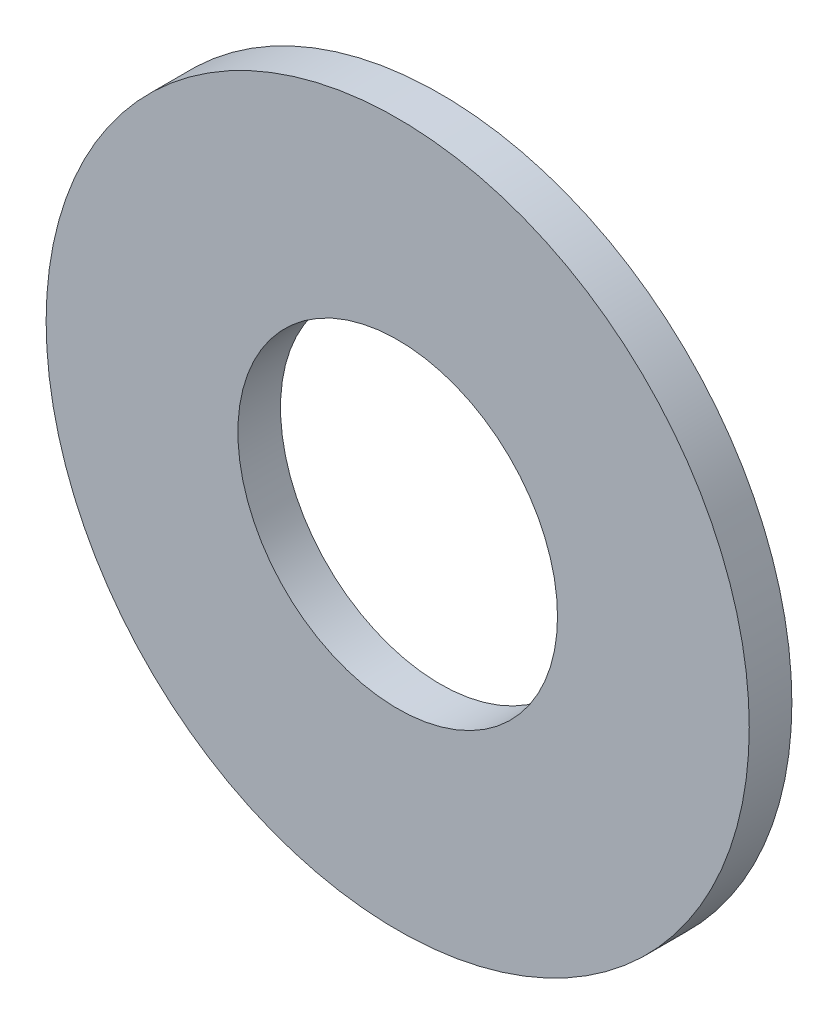
ISO-10303-21;
HEADER;
FILE_DESCRIPTION(('STEP AP214'),'2;1');
FILE_NAME('part.step','',(''),(''),'','','');
FILE_SCHEMA(('AUTOMOTIVE_DESIGN { 1 0 10303 214 1 1 1 1 }'));
ENDSEC;
DATA;
#1=APPLICATION_CONTEXT('core data for automotive mechanical design processes');
#2=APPLICATION_PROTOCOL_DEFINITION('international standard','automotive_design',2000,#1);
#3=PRODUCT_CONTEXT('',#1,'mechanical');
#4=PRODUCT('Part','Part','',(#3));
#5=PRODUCT_RELATED_PRODUCT_CATEGORY('part','',(#4));
#6=PRODUCT_DEFINITION_FORMATION('','',#4);
#7=PRODUCT_DEFINITION_CONTEXT('part definition',#1,'design');
#8=PRODUCT_DEFINITION('design','',#6,#7);
#9=PRODUCT_DEFINITION_SHAPE('','',#8);
#10=(LENGTH_UNIT() NAMED_UNIT(*) SI_UNIT(.MILLI.,.METRE.));
#11=(NAMED_UNIT(*) PLANE_ANGLE_UNIT() SI_UNIT($,.RADIAN.));
#12=(NAMED_UNIT(*) SI_UNIT($,.STERADIAN.) SOLID_ANGLE_UNIT());
#13=UNCERTAINTY_MEASURE_WITH_UNIT(LENGTH_MEASURE(1.E-05),#10,'distance_accuracy_value','');
#14=(GEOMETRIC_REPRESENTATION_CONTEXT(3) GLOBAL_UNCERTAINTY_ASSIGNED_CONTEXT((#13)) GLOBAL_UNIT_ASSIGNED_CONTEXT((#10,
#11,#12)) REPRESENTATION_CONTEXT('',''));
#15=CARTESIAN_POINT('',(0.,0.,0.));
#16=DIRECTION('',(0.,0.,1.));
#17=DIRECTION('',(1.,0.,0.));
#18=AXIS2_PLACEMENT_3D('',#15,#16,#17);
#19=CARTESIAN_POINT('',(0.,0.,10.));
#20=DIRECTION('',(0.,0.,1.));
#21=DIRECTION('',(1.,0.,0.));
#22=AXIS2_PLACEMENT_3D('',#19,#20,#21);
#23=PLANE('',#22);
#24=CARTESIAN_POINT('',(0.,0.,10.));
#25=DIRECTION('',(0.,0.,1.));
#26=DIRECTION('',(1.,0.,0.));
#27=AXIS2_PLACEMENT_3D('',#24,#25,#26);
#28=CIRCLE('',#27,82.5);
#29=CARTESIAN_POINT('',(82.5,0.,10.));
#30=VERTEX_POINT('',#29);
#31=EDGE_CURVE('E10',#30,#30,#28,.T.);
#32=ORIENTED_EDGE('',*,*,#31,.T.);
#33=EDGE_LOOP('',(#32));
#34=FACE_BOUND('',#33,.T.);
#35=CARTESIAN_POINT('',(0.,0.,10.));
#36=DIRECTION('',(0.,0.,1.));
#37=DIRECTION('',(1.,0.,0.));
#38=AXIS2_PLACEMENT_3D('',#35,#36,#37);
#39=CIRCLE('',#38,37.5);
#40=CARTESIAN_POINT('',(37.5,0.,10.));
#41=VERTEX_POINT('',#40);
#42=EDGE_CURVE('E46',#41,#41,#39,.T.);
#43=ORIENTED_EDGE('',*,*,#42,.F.);
#44=EDGE_LOOP('',(#43));
#45=FACE_BOUND('',#44,.T.);
#46=ADVANCED_FACE('F35',(#34,#45),#23,.T.);
#47=CARTESIAN_POINT('',(0.,0.,0.));
#48=DIRECTION('',(0.,0.,1.));
#49=DIRECTION('',(1.,0.,0.));
#50=AXIS2_PLACEMENT_3D('',#47,#48,#49);
#51=PLANE('',#50);
#52=CARTESIAN_POINT('',(0.,0.,0.));
#53=DIRECTION('',(0.,0.,1.));
#54=DIRECTION('',(1.,0.,0.));
#55=AXIS2_PLACEMENT_3D('',#52,#53,#54);
#56=CIRCLE('',#55,82.5);
#57=CARTESIAN_POINT('',(82.5,0.,0.));
#58=VERTEX_POINT('',#57);
#59=EDGE_CURVE('E39',#58,#58,#56,.T.);
#60=ORIENTED_EDGE('',*,*,#59,.F.);
#61=EDGE_LOOP('',(#60));
#62=FACE_BOUND('',#61,.T.);
#63=CARTESIAN_POINT('',(0.,0.,0.));
#64=DIRECTION('',(0.,0.,1.));
#65=DIRECTION('',(1.,0.,0.));
#66=AXIS2_PLACEMENT_3D('',#63,#64,#65);
#67=CIRCLE('',#66,37.5);
#68=CARTESIAN_POINT('',(37.5,0.,0.));
#69=VERTEX_POINT('',#68);
#70=EDGE_CURVE('E48',#69,#69,#67,.T.);
#71=ORIENTED_EDGE('',*,*,#70,.T.);
#72=EDGE_LOOP('',(#71));
#73=FACE_BOUND('',#72,.T.);
#74=ADVANCED_FACE('F58',(#62,#73),#51,.F.);
#75=CARTESIAN_POINT('',(0.,0.,10.));
#76=DIRECTION('',(0.,0.,-1.));
#77=DIRECTION('',(-1.,0.,0.));
#78=AXIS2_PLACEMENT_3D('',#75,#76,#77);
#79=CYLINDRICAL_SURFACE('',#78,82.5);
#80=ORIENTED_EDGE('',*,*,#31,.F.);
#81=EDGE_LOOP('',(#80));
#82=FACE_BOUND('',#81,.T.);
#83=ORIENTED_EDGE('',*,*,#59,.T.);
#84=EDGE_LOOP('',(#83));
#85=FACE_BOUND('',#84,.T.);
#86=ADVANCED_FACE('F37',(#82,#85),#79,.T.);
#87=CARTESIAN_POINT('',(0.,0.,10.));
#88=DIRECTION('',(0.,0.,-1.));
#89=DIRECTION('',(-1.,0.,0.));
#90=AXIS2_PLACEMENT_3D('',#87,#88,#89);
#91=CYLINDRICAL_SURFACE('',#90,37.5);
#92=ORIENTED_EDGE('',*,*,#42,.T.);
#93=EDGE_LOOP('',(#92));
#94=FACE_BOUND('',#93,.T.);
#95=ORIENTED_EDGE('',*,*,#70,.F.);
#96=EDGE_LOOP('',(#95));
#97=FACE_BOUND('',#96,.T.);
#98=ADVANCED_FACE('F54',(#94,#97),#91,.F.);
#99=CLOSED_SHELL('',(#46,#74,#86,#98));
#100=MANIFOLD_SOLID_BREP('B2',#99);
#101=ADVANCED_BREP_SHAPE_REPRESENTATION('',(#18,#100),#14);
#102=SHAPE_DEFINITION_REPRESENTATION(#9,#101);
ENDSEC;
END-ISO-10303-21;
